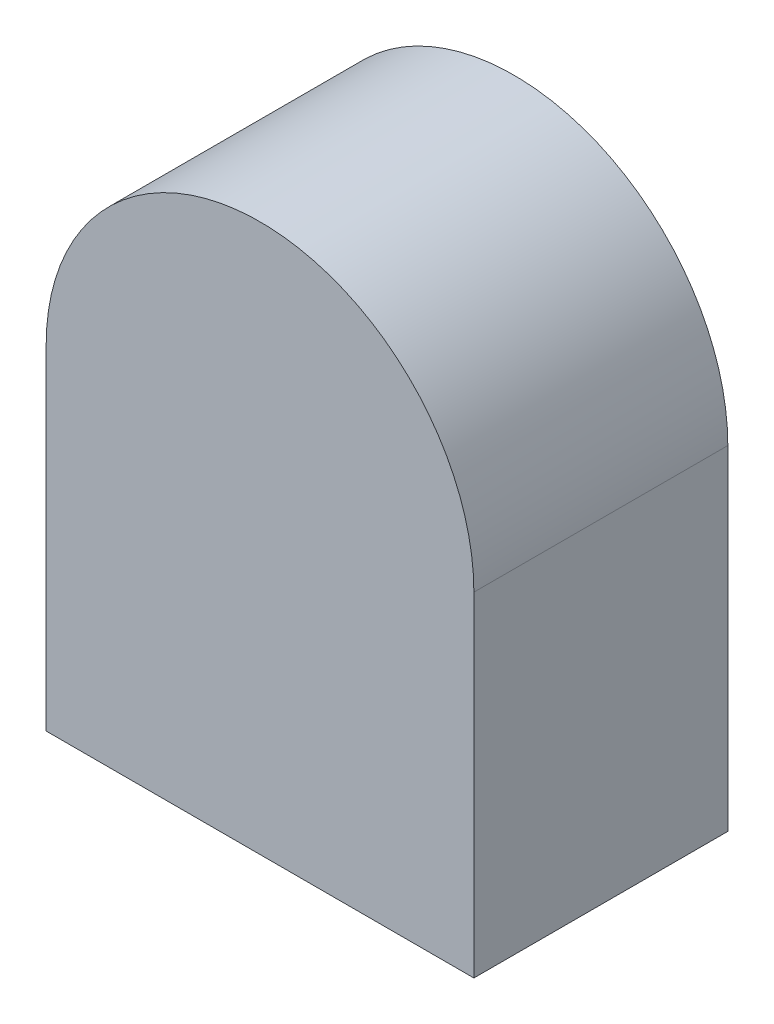
ISO-10303-21;
HEADER;
FILE_DESCRIPTION(('STEP AP214'),'2;1');
FILE_NAME('part.step','',(''),(''),'','','');
FILE_SCHEMA(('AUTOMOTIVE_DESIGN { 1 0 10303 214 1 1 1 1 }'));
ENDSEC;
DATA;
#1=APPLICATION_CONTEXT('core data for automotive mechanical design processes');
#2=APPLICATION_PROTOCOL_DEFINITION('international standard','automotive_design',2000,#1);
#3=PRODUCT_CONTEXT('',#1,'mechanical');
#4=PRODUCT('Part','Part','',(#3));
#5=PRODUCT_RELATED_PRODUCT_CATEGORY('part','',(#4));
#6=PRODUCT_DEFINITION_FORMATION('','',#4);
#7=PRODUCT_DEFINITION_CONTEXT('part definition',#1,'design');
#8=PRODUCT_DEFINITION('design','',#6,#7);
#9=PRODUCT_DEFINITION_SHAPE('','',#8);
#10=(LENGTH_UNIT() NAMED_UNIT(*) SI_UNIT(.MILLI.,.METRE.));
#11=(NAMED_UNIT(*) PLANE_ANGLE_UNIT() SI_UNIT($,.RADIAN.));
#12=(NAMED_UNIT(*) SI_UNIT($,.STERADIAN.) SOLID_ANGLE_UNIT());
#13=UNCERTAINTY_MEASURE_WITH_UNIT(LENGTH_MEASURE(1.E-05),#10,'distance_accuracy_value','');
#14=(GEOMETRIC_REPRESENTATION_CONTEXT(3) GLOBAL_UNCERTAINTY_ASSIGNED_CONTEXT((#13)) GLOBAL_UNIT_ASSIGNED_CONTEXT((#10,
#11,#12)) REPRESENTATION_CONTEXT('',''));
#15=CARTESIAN_POINT('',(0.,0.,0.));
#16=DIRECTION('',(0.,0.,1.));
#17=DIRECTION('',(1.,0.,0.));
#18=AXIS2_PLACEMENT_3D('',#15,#16,#17);
#19=CARTESIAN_POINT('',(0.,0.,19.));
#20=DIRECTION('',(0.,0.,-1.));
#21=DIRECTION('',(-1.,0.,0.));
#22=AXIS2_PLACEMENT_3D('',#19,#20,#21);
#23=CYLINDRICAL_SURFACE('',#22,16.);
#24=CARTESIAN_POINT('',(0.,0.,0.));
#25=DIRECTION('',(0.,0.,1.));
#26=DIRECTION('',(-1.,0.,0.));
#27=AXIS2_PLACEMENT_3D('',#24,#25,#26);
#28=CIRCLE('',#27,16.);
#29=CARTESIAN_POINT('',(16.,0.,0.));
#30=VERTEX_POINT('',#29);
#31=CARTESIAN_POINT('',(-16.,0.,0.));
#32=VERTEX_POINT('',#31);
#33=EDGE_CURVE('E96',#30,#32,#28,.T.);
#34=ORIENTED_EDGE('',*,*,#33,.T.);
#35=DIRECTION('',(0.,0.,-1.));
#36=VECTOR('',#35,1.);
#37=CARTESIAN_POINT('',(-16.,0.,19.));
#38=LINE('',#37,#36);
#39=CARTESIAN_POINT('',(-16.,0.,19.));
#40=VERTEX_POINT('',#39);
#41=EDGE_CURVE('E11',#40,#32,#38,.T.);
#42=ORIENTED_EDGE('',*,*,#41,.F.);
#43=CARTESIAN_POINT('',(0.,0.,19.));
#44=DIRECTION('',(0.,0.,1.));
#45=DIRECTION('',(-1.,0.,0.));
#46=AXIS2_PLACEMENT_3D('',#43,#44,#45);
#47=CIRCLE('',#46,16.);
#48=CARTESIAN_POINT('',(16.,0.,19.));
#49=VERTEX_POINT('',#48);
#50=EDGE_CURVE('E84',#49,#40,#47,.T.);
#51=ORIENTED_EDGE('',*,*,#50,.F.);
#52=DIRECTION('',(0.,0.,-1.));
#53=VECTOR('',#52,1.);
#54=CARTESIAN_POINT('',(16.,0.,19.));
#55=LINE('',#54,#53);
#56=EDGE_CURVE('E92',#49,#30,#55,.T.);
#57=ORIENTED_EDGE('',*,*,#56,.T.);
#58=EDGE_LOOP('',(#34,#42,#51,#57));
#59=FACE_BOUND('',#58,.T.);
#60=ADVANCED_FACE('F33',(#59),#23,.T.);
#61=CARTESIAN_POINT('',(-16.,0.,19.));
#62=DIRECTION('',(1.,0.,0.));
#63=DIRECTION('',(0.,0.,-1.));
#64=AXIS2_PLACEMENT_3D('',#61,#62,#63);
#65=PLANE('',#64);
#66=DIRECTION('',(0.,-1.,0.));
#67=VECTOR('',#66,1.);
#68=CARTESIAN_POINT('',(-16.,0.,0.));
#69=LINE('',#68,#67);
#70=CARTESIAN_POINT('',(-16.,-25.,0.));
#71=VERTEX_POINT('',#70);
#72=EDGE_CURVE('E88',#32,#71,#69,.T.);
#73=ORIENTED_EDGE('',*,*,#72,.T.);
#74=DIRECTION('',(0.,0.,-1.));
#75=VECTOR('',#74,1.);
#76=CARTESIAN_POINT('',(-16.,-25.,19.));
#77=LINE('',#76,#75);
#78=CARTESIAN_POINT('',(-16.,-25.,19.));
#79=VERTEX_POINT('',#78);
#80=EDGE_CURVE('E41',#79,#71,#77,.T.);
#81=ORIENTED_EDGE('',*,*,#80,.F.);
#82=DIRECTION('',(0.,-1.,0.));
#83=VECTOR('',#82,1.);
#84=CARTESIAN_POINT('',(-16.,0.,19.));
#85=LINE('',#84,#83);
#86=EDGE_CURVE('E79',#40,#79,#85,.T.);
#87=ORIENTED_EDGE('',*,*,#86,.F.);
#88=ORIENTED_EDGE('',*,*,#41,.T.);
#89=EDGE_LOOP('',(#73,#81,#87,#88));
#90=FACE_BOUND('',#89,.T.);
#91=ADVANCED_FACE('F87',(#90),#65,.F.);
#92=CARTESIAN_POINT('',(-16.,-25.,19.));
#93=DIRECTION('',(0.,1.,0.));
#94=DIRECTION('',(0.,0.,1.));
#95=AXIS2_PLACEMENT_3D('',#92,#93,#94);
#96=PLANE('',#95);
#97=DIRECTION('',(1.,0.,0.));
#98=VECTOR('',#97,1.);
#99=CARTESIAN_POINT('',(-16.,-25.,0.));
#100=LINE('',#99,#98);
#101=CARTESIAN_POINT('',(16.,-25.,0.));
#102=VERTEX_POINT('',#101);
#103=EDGE_CURVE('E66',#71,#102,#100,.T.);
#104=ORIENTED_EDGE('',*,*,#103,.T.);
#105=DIRECTION('',(0.,0.,-1.));
#106=VECTOR('',#105,1.);
#107=CARTESIAN_POINT('',(16.,-25.,19.));
#108=LINE('',#107,#106);
#109=CARTESIAN_POINT('',(16.,-25.,19.));
#110=VERTEX_POINT('',#109);
#111=EDGE_CURVE('E89',#110,#102,#108,.T.);
#112=ORIENTED_EDGE('',*,*,#111,.F.);
#113=DIRECTION('',(1.,0.,0.));
#114=VECTOR('',#113,1.);
#115=CARTESIAN_POINT('',(-16.,-25.,19.));
#116=LINE('',#115,#114);
#117=EDGE_CURVE('E82',#79,#110,#116,.T.);
#118=ORIENTED_EDGE('',*,*,#117,.F.);
#119=ORIENTED_EDGE('',*,*,#80,.T.);
#120=EDGE_LOOP('',(#104,#112,#118,#119));
#121=FACE_BOUND('',#120,.T.);
#122=ADVANCED_FACE('F90',(#121),#96,.F.);
#123=CARTESIAN_POINT('',(16.,-25.,19.));
#124=DIRECTION('',(-1.,0.,0.));
#125=DIRECTION('',(0.,0.,1.));
#126=AXIS2_PLACEMENT_3D('',#123,#124,#125);
#127=PLANE('',#126);
#128=DIRECTION('',(0.,1.,0.));
#129=VECTOR('',#128,1.);
#130=CARTESIAN_POINT('',(16.,-25.,0.));
#131=LINE('',#130,#129);
#132=EDGE_CURVE('E72',#102,#30,#131,.T.);
#133=ORIENTED_EDGE('',*,*,#132,.T.);
#134=ORIENTED_EDGE('',*,*,#56,.F.);
#135=DIRECTION('',(0.,1.,0.));
#136=VECTOR('',#135,1.);
#137=CARTESIAN_POINT('',(16.,-25.,19.));
#138=LINE('',#137,#136);
#139=EDGE_CURVE('E49',#110,#49,#138,.T.);
#140=ORIENTED_EDGE('',*,*,#139,.F.);
#141=ORIENTED_EDGE('',*,*,#111,.T.);
#142=EDGE_LOOP('',(#133,#134,#140,#141));
#143=FACE_BOUND('',#142,.T.);
#144=ADVANCED_FACE('F104',(#143),#127,.F.);
#145=CARTESIAN_POINT('',(0.,0.,19.));
#146=DIRECTION('',(0.,0.,-1.));
#147=DIRECTION('',(-1.,0.,0.));
#148=AXIS2_PLACEMENT_3D('',#145,#146,#147);
#149=PLANE('',#148);
#150=ORIENTED_EDGE('',*,*,#50,.T.);
#151=ORIENTED_EDGE('',*,*,#86,.T.);
#152=ORIENTED_EDGE('',*,*,#117,.T.);
#153=ORIENTED_EDGE('',*,*,#139,.T.);
#154=EDGE_LOOP('',(#150,#151,#152,#153));
#155=FACE_BOUND('',#154,.T.);
#156=ADVANCED_FACE('F80',(#155),#149,.F.);
#157=CARTESIAN_POINT('',(0.,0.,0.));
#158=DIRECTION('',(0.,0.,-1.));
#159=DIRECTION('',(-1.,0.,0.));
#160=AXIS2_PLACEMENT_3D('',#157,#158,#159);
#161=PLANE('',#160);
#162=CARTESIAN_POINT('',(0.,0.,0.));
#163=DIRECTION('',(0.,0.,-1.));
#164=DIRECTION('',(-1.,0.,0.));
#165=AXIS2_PLACEMENT_3D('',#162,#163,#164);
#166=CIRCLE('',#165,5.);
#167=CARTESIAN_POINT('',(-5.,0.,0.));
#168=VERTEX_POINT('',#167);
#169=EDGE_CURVE('E110',#168,#168,#166,.T.);
#170=ORIENTED_EDGE('',*,*,#169,.F.);
#171=EDGE_LOOP('',(#170));
#172=FACE_BOUND('',#171,.T.);
#173=ORIENTED_EDGE('',*,*,#33,.F.);
#174=ORIENTED_EDGE('',*,*,#132,.F.);
#175=ORIENTED_EDGE('',*,*,#103,.F.);
#176=ORIENTED_EDGE('',*,*,#72,.F.);
#177=EDGE_LOOP('',(#173,#174,#175,#176));
#178=FACE_BOUND('',#177,.T.);
#179=ADVANCED_FACE('F107',(#172,#178),#161,.T.);
#180=CARTESIAN_POINT('',(0.,0.,2.));
#181=DIRECTION('',(0.,0.,-1.));
#182=DIRECTION('',(-1.,0.,0.));
#183=AXIS2_PLACEMENT_3D('',#180,#181,#182);
#184=CYLINDRICAL_SURFACE('',#183,5.);
#185=CARTESIAN_POINT('',(0.,0.,2.));
#186=DIRECTION('',(0.,0.,-1.));
#187=DIRECTION('',(-1.,0.,0.));
#188=AXIS2_PLACEMENT_3D('',#185,#186,#187);
#189=CIRCLE('',#188,5.);
#190=CARTESIAN_POINT('',(-5.,0.,2.));
#191=VERTEX_POINT('',#190);
#192=EDGE_CURVE('E99',#191,#191,#189,.T.);
#193=ORIENTED_EDGE('',*,*,#192,.F.);
#194=EDGE_LOOP('',(#193));
#195=FACE_BOUND('',#194,.T.);
#196=ORIENTED_EDGE('',*,*,#169,.T.);
#197=EDGE_LOOP('',(#196));
#198=FACE_BOUND('',#197,.T.);
#199=ADVANCED_FACE('F133',(#195,#198),#184,.F.);
#200=CARTESIAN_POINT('',(0.,0.,2.));
#201=DIRECTION('',(0.,0.,-1.));
#202=DIRECTION('',(-1.,0.,0.));
#203=AXIS2_PLACEMENT_3D('',#200,#201,#202);
#204=PLANE('',#203);
#205=CARTESIAN_POINT('',(0.,0.,2.));
#206=DIRECTION('',(0.,0.,-1.));
#207=DIRECTION('',(-1.,0.,0.));
#208=AXIS2_PLACEMENT_3D('',#205,#206,#207);
#209=CIRCLE('',#208,1.5);
#210=CARTESIAN_POINT('',(-1.5,0.,2.));
#211=VERTEX_POINT('',#210);
#212=EDGE_CURVE('E116',#211,#211,#209,.T.);
#213=ORIENTED_EDGE('',*,*,#212,.F.);
#214=EDGE_LOOP('',(#213));
#215=FACE_BOUND('',#214,.T.);
#216=ORIENTED_EDGE('',*,*,#192,.T.);
#217=EDGE_LOOP('',(#216));
#218=FACE_BOUND('',#217,.T.);
#219=ADVANCED_FACE('F127',(#215,#218),#204,.T.);
#220=CARTESIAN_POINT('',(0.,0.,12.));
#221=DIRECTION('',(0.,0.,-1.));
#222=DIRECTION('',(-1.,0.,0.));
#223=AXIS2_PLACEMENT_3D('',#220,#221,#222);
#224=CYLINDRICAL_SURFACE('',#223,1.5);
#225=CARTESIAN_POINT('',(0.,0.,12.));
#226=DIRECTION('',(0.,0.,-1.));
#227=DIRECTION('',(-1.,0.,0.));
#228=AXIS2_PLACEMENT_3D('',#225,#226,#227);
#229=CIRCLE('',#228,1.5);
#230=CARTESIAN_POINT('',(-1.5,0.,12.));
#231=VERTEX_POINT('',#230);
#232=EDGE_CURVE('E113',#231,#231,#229,.T.);
#233=ORIENTED_EDGE('',*,*,#232,.F.);
#234=EDGE_LOOP('',(#233));
#235=FACE_BOUND('',#234,.T.);
#236=ORIENTED_EDGE('',*,*,#212,.T.);
#237=EDGE_LOOP('',(#236));
#238=FACE_BOUND('',#237,.T.);
#239=ADVANCED_FACE('F124',(#235,#238),#224,.F.);
#240=CARTESIAN_POINT('',(0.,0.,12.));
#241=DIRECTION('',(0.,0.,-1.));
#242=DIRECTION('',(-1.,0.,0.));
#243=AXIS2_PLACEMENT_3D('',#240,#241,#242);
#244=PLANE('',#243);
#245=ORIENTED_EDGE('',*,*,#232,.T.);
#246=EDGE_LOOP('',(#245));
#247=FACE_BOUND('',#246,.T.);
#248=ADVANCED_FACE('F122',(#247),#244,.T.);
#249=CLOSED_SHELL('',(#60,#91,#122,#144,#156,#179,#199,#219,#239,#248));
#250=MANIFOLD_SOLID_BREP('B2',#249);
#251=ADVANCED_BREP_SHAPE_REPRESENTATION('',(#18,#250),#14);
#252=SHAPE_DEFINITION_REPRESENTATION(#9,#251);
ENDSEC;
END-ISO-10303-21;
